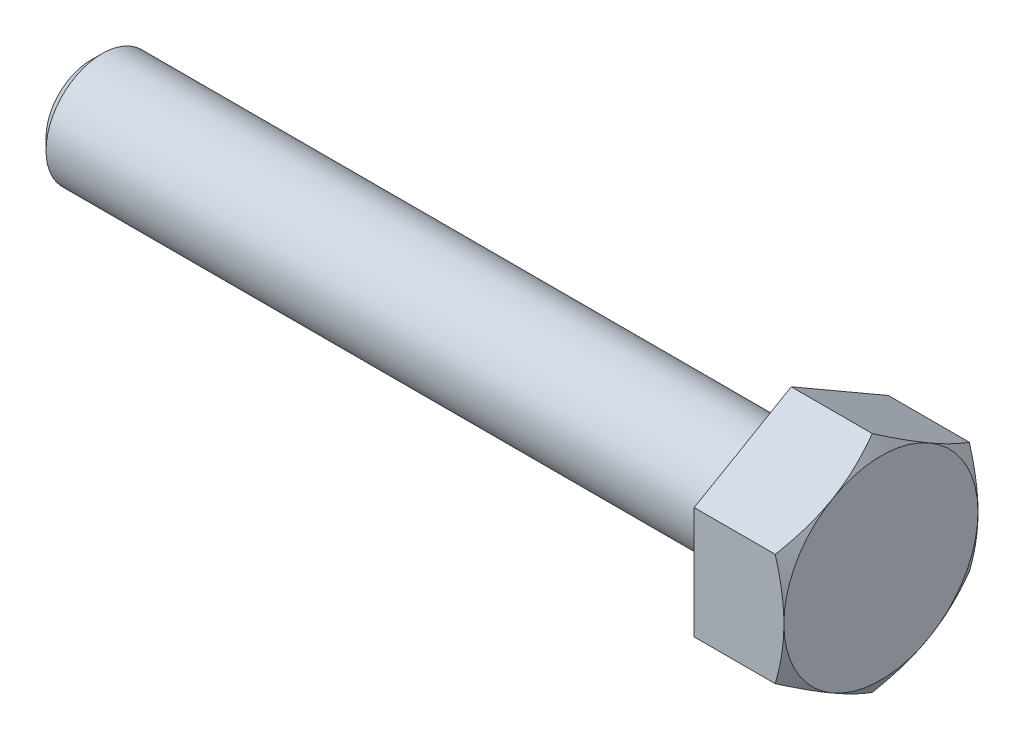
ISO-10303-21;
HEADER;
FILE_DESCRIPTION(('STEP AP214'),'2;1');
FILE_NAME('part.step','',(''),(''),'','','');
FILE_SCHEMA(('AUTOMOTIVE_DESIGN { 1 0 10303 214 1 1 1 1 }'));
ENDSEC;
DATA;
#1=APPLICATION_CONTEXT('core data for automotive mechanical design processes');
#2=APPLICATION_PROTOCOL_DEFINITION('international standard','automotive_design',2000,#1);
#3=PRODUCT_CONTEXT('',#1,'mechanical');
#4=PRODUCT('Part','Part','',(#3));
#5=PRODUCT_RELATED_PRODUCT_CATEGORY('part','',(#4));
#6=PRODUCT_DEFINITION_FORMATION('','',#4);
#7=PRODUCT_DEFINITION_CONTEXT('part definition',#1,'design');
#8=PRODUCT_DEFINITION('design','',#6,#7);
#9=PRODUCT_DEFINITION_SHAPE('','',#8);
#10=(LENGTH_UNIT() NAMED_UNIT(*) SI_UNIT(.MILLI.,.METRE.));
#11=(NAMED_UNIT(*) PLANE_ANGLE_UNIT() SI_UNIT($,.RADIAN.));
#12=(NAMED_UNIT(*) SI_UNIT($,.STERADIAN.) SOLID_ANGLE_UNIT());
#13=UNCERTAINTY_MEASURE_WITH_UNIT(LENGTH_MEASURE(1.E-05),#10,'distance_accuracy_value','');
#14=(GEOMETRIC_REPRESENTATION_CONTEXT(3) GLOBAL_UNCERTAINTY_ASSIGNED_CONTEXT((#13)) GLOBAL_UNIT_ASSIGNED_CONTEXT((#10,
#11,#12)) REPRESENTATION_CONTEXT('',''));
#15=CARTESIAN_POINT('',(0.,0.,0.));
#16=DIRECTION('',(0.,0.,1.));
#17=DIRECTION('',(1.,0.,0.));
#18=AXIS2_PLACEMENT_3D('',#15,#16,#17);
#19=CARTESIAN_POINT('',(19.2,12.0000000000002,-20.7846096908263));
#20=DIRECTION('',(0.,-0.866025403784441,0.499999999999995));
#21=DIRECTION('',(0.,-0.499999999999995,-0.866025403784441));
#22=AXIS2_PLACEMENT_3D('',#19,#20,#21);
#23=PLANE('',#22);
#24=CARTESIAN_POINT('',(17.3435268723012,11.9998845299464,-20.7848096908263));
#25=CARTESIAN_POINT('',(17.4957950231701,12.263639438313,-20.3279727887896));
#26=CARTESIAN_POINT('',(17.6411534574922,12.5284231322604,-19.869353977857));
#27=CARTESIAN_POINT('',(17.9161302416855,13.0601137691591,-18.9484387808398));
#28=CARTESIAN_POINT('',(18.0457434146858,13.3270213798631,-18.4861412381737));
#29=CARTESIAN_POINT('',(18.2874874041532,13.8634756923536,-17.5569751130007));
#30=CARTESIAN_POINT('',(18.3995768558665,14.1330270885873,-17.0900983994728));
#31=CARTESIAN_POINT('',(18.6038664716216,14.6740028630394,-16.1531008724577));
#32=CARTESIAN_POINT('',(18.6960677747242,14.9454271330728,-15.6829802463526));
#33=CARTESIAN_POINT('',(18.8566595090508,15.4831938662328,-14.7515409418991));
#34=CARTESIAN_POINT('',(18.9255814723418,15.749496406001,-14.290291412836));
#35=CARTESIAN_POINT('',(19.0411479838631,16.2833217102037,-13.3656788635909));
#36=CARTESIAN_POINT('',(19.0877921032801,16.5508444980261,-12.9023158029001));
#37=CARTESIAN_POINT('',(19.1576251858172,17.0863394659308,-11.9748113112916));
#38=CARTESIAN_POINT('',(19.1808420204719,17.3543107311896,-11.5106714648949));
#39=CARTESIAN_POINT('',(19.2033212604246,17.8905005573785,-10.5819634434342));
#40=CARTESIAN_POINT('',(19.2025844059287,18.158719110411,-10.1173952820493));
#41=CARTESIAN_POINT('',(19.178829236137,18.6601588540008,-9.24887616921747));
#42=CARTESIAN_POINT('',(19.1587076543317,18.8934157559949,-8.8448633637475));
#43=CARTESIAN_POINT('',(19.1007301929937,19.3593726906645,-8.0378022787607));
#44=CARTESIAN_POINT('',(19.0628745674587,19.5920727312677,-7.63475398551264));
#45=CARTESIAN_POINT('',(18.9700851020353,20.0568299673038,-6.82977083951278));
#46=CARTESIAN_POINT('',(18.9151358186335,20.2888863892026,-6.42783732656154));
#47=CARTESIAN_POINT('',(18.7891315548784,20.751888101785,-5.62589483637743));
#48=CARTESIAN_POINT('',(18.7180766427663,20.9828333971723,-5.22588585099749));
#49=CARTESIAN_POINT('',(18.4789299412627,21.6839341778009,-4.01154367772255));
#50=CARTESIAN_POINT('',(18.2869794527174,22.1520977019199,-3.20066066769793));
#51=CARTESIAN_POINT('',(17.9601926803062,22.8491727977797,-1.99329118497793));
#52=CARTESIAN_POINT('',(17.8449045107318,23.0804697165365,-1.59267317005701));
#53=CARTESIAN_POINT('',(17.6026566529107,23.541463698911,-0.794208170600846));
#54=CARTESIAN_POINT('',(17.4757002543211,23.7711611939319,-0.396360438853308));
#55=CARTESIAN_POINT('',(17.3435268723012,24.0001154700538,0.000199999999998563));
#56=B_SPLINE_CURVE_WITH_KNOTS('',3,(#24,#25,#26,#27,#28,#29,#30,#31,#32,#33,#34,#35,#36,#37,#38,
#39,#40,#41,#42,#43,#44,#45,#46,#47,#48,#49,#50,#51,#52,#53,#54,#55),.UNSPECIFIED.,.F.,.F.,(4,2,
2,2,2,2,2,2,2,2,2,2,2,2,2,4),(0.,1.64718297300076,3.2949060644356,4.94646171874213,
6.59792275780599,8.20862232704058,9.81935289844247,11.4281649098404,13.0369272065082,
14.4374315945823,15.8379159244003,17.239669235012,18.6414166063711,21.5066563429883,
22.9367804503369,24.366502588349),.UNSPECIFIED.);
#57=CARTESIAN_POINT('',(17.343593539449,12.0000000000003,-20.7846096908263));
#58=VERTEX_POINT('',#57);
#59=CARTESIAN_POINT('',(19.2,18.,-10.3923048454131));
#60=VERTEX_POINT('',#59);
#61=EDGE_CURVE('E124',#58,#60,#56,.T.);
#62=ORIENTED_EDGE('',*,*,#61,.F.);
#63=DIRECTION('',(-1.,0.,0.));
#64=VECTOR('',#63,1.);
#65=CARTESIAN_POINT('',(19.2,12.0000000000002,-20.7846096908263));
#66=LINE('',#65,#64);
#67=CARTESIAN_POINT('',(0.,12.0000000000002,-20.7846096908263));
#68=VERTEX_POINT('',#67);
#69=EDGE_CURVE('E73',#58,#68,#66,.T.);
#70=ORIENTED_EDGE('',*,*,#69,.T.);
#71=DIRECTION('',(0.,0.499999999999995,0.866025403784442));
#72=VECTOR('',#71,1.);
#73=CARTESIAN_POINT('',(0.,12.0000000000002,-20.7846096908263));
#74=LINE('',#73,#72);
#75=CARTESIAN_POINT('',(0.,24.,0.));
#76=VERTEX_POINT('',#75);
#77=EDGE_CURVE('E131',#68,#76,#74,.T.);
#78=ORIENTED_EDGE('',*,*,#77,.T.);
#79=DIRECTION('',(-1.,0.,0.));
#80=VECTOR('',#79,1.);
#81=CARTESIAN_POINT('',(19.2,24.,0.));
#82=LINE('',#81,#80);
#83=CARTESIAN_POINT('',(17.343593539449,24.,0.));
#84=VERTEX_POINT('',#83);
#85=EDGE_CURVE('E144',#84,#76,#82,.T.);
#86=ORIENTED_EDGE('',*,*,#85,.F.);
#87=EDGE_CURVE('E132',#60,#84,#56,.T.);
#88=ORIENTED_EDGE('',*,*,#87,.F.);
#89=EDGE_LOOP('',(#62,#70,#78,#86,#88));
#90=FACE_BOUND('',#89,.T.);
#91=ADVANCED_FACE('F49',(#90),#23,.F.);
#92=CARTESIAN_POINT('',(19.2,24.,0.));
#93=DIRECTION('',(0.,-0.866025403784438,-0.500000000000001));
#94=DIRECTION('',(0.,0.500000000000001,-0.866025403784438));
#95=AXIS2_PLACEMENT_3D('',#92,#93,#94);
#96=PLANE('',#95);
#97=CARTESIAN_POINT('',(17.3435268723012,24.0001154700538,-0.0002));
#98=CARTESIAN_POINT('',(17.4957950231701,23.7363605616871,0.456636902036743));
#99=CARTESIAN_POINT('',(17.6411534574922,23.4715768677398,0.915255712969346));
#100=CARTESIAN_POINT('',(17.9161302416855,22.9398862308411,1.83617090998652));
#101=CARTESIAN_POINT('',(18.0457434146858,22.6729786201371,2.29846845265265));
#102=CARTESIAN_POINT('',(18.2874874041532,22.1365243076466,3.22763457782561));
#103=CARTESIAN_POINT('',(18.3995768558665,21.8669729114129,3.69451129135352));
#104=CARTESIAN_POINT('',(18.6038664716216,21.3259971369607,4.63150881836862));
#105=CARTESIAN_POINT('',(18.6960677747242,21.0545728669273,5.10162944447371));
#106=CARTESIAN_POINT('',(18.8566595090508,20.5168061337673,6.03306874892723));
#107=CARTESIAN_POINT('',(18.9255814723418,20.2505035939992,6.49431827799028));
#108=CARTESIAN_POINT('',(19.0411479838631,19.7166782897964,7.41893082723536));
#109=CARTESIAN_POINT('',(19.0877921032801,19.449155501974,7.88229388792625));
#110=CARTESIAN_POINT('',(19.1576251858173,18.9136605340693,8.80979837953467));
#111=CARTESIAN_POINT('',(19.180842020472,18.6456892688105,9.27393822593137));
#112=CARTESIAN_POINT('',(19.2033212604247,18.1094994426216,10.2026462473921));
#113=CARTESIAN_POINT('',(19.2025844059287,17.8412808895891,10.667214408777));
#114=CARTESIAN_POINT('',(19.178829236137,17.3398411459993,11.5357335216088));
#115=CARTESIAN_POINT('',(19.1587076543318,17.1065842440051,11.9397463270788));
#116=CARTESIAN_POINT('',(19.1007301929938,16.6406273093355,12.7468074120656));
#117=CARTESIAN_POINT('',(19.0628745674587,16.4079272687323,13.1498557053137));
#118=CARTESIAN_POINT('',(18.9700851020354,15.9431700326962,13.9548388513136));
#119=CARTESIAN_POINT('',(18.9151358186335,15.7111136107975,14.3567723642648));
#120=CARTESIAN_POINT('',(18.7891315548785,15.2481118982151,15.1587148544489));
#121=CARTESIAN_POINT('',(18.7180766427664,15.0171666028277,15.5587238398289));
#122=CARTESIAN_POINT('',(18.4789299412628,14.316065822199,16.7730660131039));
#123=CARTESIAN_POINT('',(18.2869794527175,13.84790229808,17.5839490231285));
#124=CARTESIAN_POINT('',(17.9601926803062,13.1508272022203,18.7913185058485));
#125=CARTESIAN_POINT('',(17.8449045107319,12.9195302834635,19.1919365207695));
#126=CARTESIAN_POINT('',(17.6026566529107,12.4585363010889,19.9904015202257));
#127=CARTESIAN_POINT('',(17.4757002543211,12.228838806068,20.3882492519732));
#128=CARTESIAN_POINT('',(17.3435268723012,11.9998845299461,20.7848096908265));
#129=B_SPLINE_CURVE_WITH_KNOTS('',3,(#97,#98,#99,#100,#101,#102,#103,#104,#105,#106,#107,#108,
#109,#110,#111,#112,#113,#114,#115,#116,#117,#118,#119,#120,#121,#122,#123,#124,#125,#126,#127,
#128),.UNSPECIFIED.,.F.,.F.,(4,2,2,2,2,2,2,2,2,2,2,2,2,2,2,4),(0.,1.64718297300076,
3.2949060644356,4.94646171874214,6.597922757806,8.20862232704059,9.81935289844247,
11.4281649098404,13.0369272065082,14.4374315945823,15.8379159244004,17.2396692350121,
18.6414166063712,21.5066563429886,22.9367804503372,24.3665025883493),.UNSPECIFIED.);
#130=CARTESIAN_POINT('',(19.2,17.9999999999999,10.3923048454133));
#131=VERTEX_POINT('',#130);
#132=EDGE_CURVE('E137',#84,#131,#129,.T.);
#133=ORIENTED_EDGE('',*,*,#132,.F.);
#134=ORIENTED_EDGE('',*,*,#85,.T.);
#135=DIRECTION('',(0.,-0.500000000000001,0.866025403784438));
#136=VECTOR('',#135,1.);
#137=CARTESIAN_POINT('',(0.,24.,0.));
#138=LINE('',#137,#136);
#139=CARTESIAN_POINT('',(0.,11.9999999999999,20.7846096908265));
#140=VERTEX_POINT('',#139);
#141=EDGE_CURVE('E278',#76,#140,#138,.T.);
#142=ORIENTED_EDGE('',*,*,#141,.T.);
#143=DIRECTION('',(-1.,0.,0.));
#144=VECTOR('',#143,1.);
#145=CARTESIAN_POINT('',(19.2,11.9999999999999,20.7846096908265));
#146=LINE('',#145,#144);
#147=CARTESIAN_POINT('',(17.343593539449,11.9999999999999,20.7846096908265));
#148=VERTEX_POINT('',#147);
#149=EDGE_CURVE('E217',#148,#140,#146,.T.);
#150=ORIENTED_EDGE('',*,*,#149,.F.);
#151=EDGE_CURVE('E145',#131,#148,#129,.T.);
#152=ORIENTED_EDGE('',*,*,#151,.F.);
#153=EDGE_LOOP('',(#133,#134,#142,#150,#152));
#154=FACE_BOUND('',#153,.T.);
#155=ADVANCED_FACE('F205',(#154),#96,.F.);
#156=CARTESIAN_POINT('',(19.2,11.9999999999999,20.7846096908265));
#157=DIRECTION('',(0.,0.,-1.));
#158=DIRECTION('',(0.,1.,0.));
#159=AXIS2_PLACEMENT_3D('',#156,#157,#158);
#160=PLANE('',#159);
#161=CARTESIAN_POINT('',(3.76342461730577,42.7351963396776,20.7846096908266));
#162=CARTESIAN_POINT('',(4.0217998769859,42.2375504579258,20.7846096908266));
#163=CARTESIAN_POINT('',(4.27949915757842,41.7395537279378,20.7846096908266));
#164=CARTESIAN_POINT('',(4.79340647647786,40.7427897192708,20.7846096908266));
#165=CARTESIAN_POINT('',(5.0496145105572,40.2440224384125,20.7846096908266));
#166=CARTESIAN_POINT('',(5.81581250232179,38.7464229614953,20.7846096908266));
#167=CARTESIAN_POINT('',(6.32335419205207,37.7463357499288,20.7846096908266));
#168=CARTESIAN_POINT('',(7.33129538895053,35.7405852853729,20.7846096908266));
#169=CARTESIAN_POINT('',(7.83168234761047,34.7349157197308,20.7846096908266));
#170=CARTESIAN_POINT('',(8.82264705551387,32.718765685221,20.7846096908266));
#171=CARTESIAN_POINT('',(9.31322495581521,31.7082852907364,20.7846096908266));
#172=CARTESIAN_POINT('',(10.3090178760169,29.6253151675214,20.7846096908266));
#173=CARTESIAN_POINT('',(10.8135374476021,28.5524923063502,20.7846096908266));
#174=CARTESIAN_POINT('',(11.8052265689669,26.3987607200869,20.7846096908266));
#175=CARTESIAN_POINT('',(12.2923953981161,25.3178516614009,20.7846096908266));
#176=CARTESIAN_POINT('',(13.0060408898936,23.6893359387003,20.7846096908266));
#177=CARTESIAN_POINT('',(13.241012036702,23.1454489410645,20.7846096908265));
#178=CARTESIAN_POINT('',(13.7044499258193,22.0549139153183,20.7846096908265));
#179=CARTESIAN_POINT('',(13.9329167531097,21.5082659233914,20.7846096908265));
#180=CARTESIAN_POINT('',(14.3823664080821,20.4119412090459,20.7846096908265));
#181=CARTESIAN_POINT('',(14.6033497579944,19.862264701096,20.7846096908265));
#182=CARTESIAN_POINT('',(15.0366990711674,18.7595322812737,20.7846096908265));
#183=CARTESIAN_POINT('',(15.2490652080702,18.2064764377554,20.7846096908265));
#184=CARTESIAN_POINT('',(15.6903533859146,17.0257175003697,20.7846096908265));
#185=CARTESIAN_POINT('',(15.9179230026686,16.3975069770107,20.7846096908265));
#186=CARTESIAN_POINT('',(16.3581471300787,15.1358634730651,20.7846096908265));
#187=CARTESIAN_POINT('',(16.5708016751309,14.5024305045259,20.7846096908265));
#188=CARTESIAN_POINT('',(16.97857202958,13.2297874539747,20.7846096908265));
#189=CARTESIAN_POINT('',(17.1736845821637,12.5905763233441,20.7846096908265));
#190=CARTESIAN_POINT('',(17.5432592250528,11.3061766050274,20.7846096908265));
#191=CARTESIAN_POINT('',(17.7177213464759,10.6609880263502,20.7846096908265));
#192=CARTESIAN_POINT('',(18.0393055717577,9.37757944037587,20.7846096908265));
#193=CARTESIAN_POINT('',(18.1869070802664,8.73948035870569,20.7846096908265));
#194=CARTESIAN_POINT('',(18.4555718401117,7.45773163993489,20.7846096908265));
#195=CARTESIAN_POINT('',(18.5766374182426,6.81408249463781,20.7846096908265));
#196=CARTESIAN_POINT('',(18.7888399212671,5.52212335543818,20.7846096908265));
#197=CARTESIAN_POINT('',(18.879990457561,4.87381561880363,20.7846096908265));
#198=CARTESIAN_POINT('',(19.0294981172202,3.57339987577268,20.7846096908265));
#199=CARTESIAN_POINT('',(19.0878557255006,2.9212919257148,20.7846096908265));
#200=CARTESIAN_POINT('',(19.1703140665286,1.604632924159,20.7846096908265));
#201=CARTESIAN_POINT('',(19.1938641321273,0.940046910142519,20.7846096908265));
#202=CARTESIAN_POINT('',(19.204030391089,-0.389409138129768,20.7846096908265));
#203=CARTESIAN_POINT('',(19.1906466331135,-1.05427917201021,20.7846096908265));
#204=CARTESIAN_POINT('',(19.127473258216,-2.38241239876372,20.7846096908265));
#205=CARTESIAN_POINT('',(19.0776756810162,-3.04567520847451,20.7846096908265));
#206=CARTESIAN_POINT('',(18.9435587785108,-4.36867761851296,20.7846096908265));
#207=CARTESIAN_POINT('',(18.8592385439934,-5.02841712558492,20.7846096908265));
#208=CARTESIAN_POINT('',(18.6568671457578,-6.35687047190902,20.7846096908264));
#209=CARTESIAN_POINT('',(18.5381432508851,-7.02548085274418,20.7846096908264));
#210=CARTESIAN_POINT('',(18.271401694146,-8.35678717792432,20.7846096908264));
#211=CARTESIAN_POINT('',(18.1233835768543,-9.01948303015111,20.7846096908264));
#212=CARTESIAN_POINT('',(17.8018250395631,-10.3388158753969,20.7846096908264));
#213=CARTESIAN_POINT('',(17.6282769895872,-10.9954509945151,20.7846096908264));
#214=CARTESIAN_POINT('',(17.2593302530432,-12.3025159921133,20.7846096908264));
#215=CARTESIAN_POINT('',(17.0639314973765,-12.9529458509631,20.7846096908264));
#216=CARTESIAN_POINT('',(16.6521235226639,-14.2556215747884,20.7846096908264));
#217=CARTESIAN_POINT('',(16.4354916580091,-14.9077966991281,20.7846096908264));
#218=CARTESIAN_POINT('',(15.9861491034795,-16.2066062021254,20.7846096908264));
#219=CARTESIAN_POINT('',(15.7534373926133,-16.8532402260149,20.7846096908264));
#220=CARTESIAN_POINT('',(15.274391678855,-18.1416069191262,20.7846096908264));
#221=CARTESIAN_POINT('',(15.0280543260464,-18.7833383384918,20.7846096908264));
#222=CARTESIAN_POINT('',(14.5239117501619,-20.0622534059696,20.7846096908264));
#223=CARTESIAN_POINT('',(14.2661067525744,-20.6994371432174,20.7846096908264));
#224=CARTESIAN_POINT('',(13.7404274743531,-21.9705929002849,20.7846096908264));
#225=CARTESIAN_POINT('',(13.472540609056,-22.6045597040991,20.7846096908264));
#226=CARTESIAN_POINT('',(12.9284600902016,-23.8689150095967,20.7846096908264));
#227=CARTESIAN_POINT('',(12.6522664037446,-24.4993034970964,20.7846096908264));
#228=CARTESIAN_POINT('',(12.0928140658874,-25.7568294075045,20.7846096908264));
#229=CARTESIAN_POINT('',(11.8095563903339,-26.3839672651679,20.7846096908264));
#230=CARTESIAN_POINT('',(11.2369322661728,-27.6354418873609,20.7846096908264));
#231=CARTESIAN_POINT('',(10.9475658301735,-28.2597786576686,20.7846096908264));
#232=CARTESIAN_POINT('',(10.1073878955883,-30.052670015556,20.7846096908264));
#233=CARTESIAN_POINT('',(9.549935979559,-31.2181138600505,20.7846096908264));
#234=CARTESIAN_POINT('',(8.42077327483183,-33.5421025420666,20.7846096908264));
#235=CARTESIAN_POINT('',(7.84906192836635,-34.7006471075152,20.7846096908264));
#236=CARTESIAN_POINT('',(6.69664324710512,-37.0077945469624,20.7846096908264));
#237=CARTESIAN_POINT('',(6.11597792943075,-38.1564184327318,20.7846096908263));
#238=CARTESIAN_POINT('',(5.23838112008893,-39.8759132018086,20.7846096908263));
#239=CARTESIAN_POINT('',(4.94476224673455,-40.4484792332989,20.7846096908263));
#240=CARTESIAN_POINT('',(4.35553330993649,-41.5925826559037,20.7846096908263));
#241=CARTESIAN_POINT('',(4.0599232555947,-42.164120051705,20.7846096908263));
#242=CARTESIAN_POINT('',(3.76342461730577,-42.7351963396777,20.7846096908263));
#243=B_SPLINE_CURVE_WITH_KNOTS('',3,(#161,#162,#163,#164,#165,#166,#167,#168,#169,#170,#171,
#172,#173,#174,#175,#176,#177,#178,#179,#180,#181,#182,#183,#184,#185,#186,#187,#188,#189,#190,
#191,#192,#193,#194,#195,#196,#197,#198,#199,#200,#201,#202,#203,#204,#205,#206,#207,#208,#209,
#210,#211,#212,#213,#214,#215,#216,#217,#218,#219,#220,#221,#222,#223,#224,#225,#226,#227,#228,
#229,#230,#231,#232,#233,#234,#235,#236,#237,#238,#239,#240,#241,#242),.UNSPECIFIED.,.F.,.F.,(4,
2,2,2,2,2,2,2,2,2,2,2,2,2,2,2,2,2,2,2,2,2,2,2,2,2,2,2,2,2,2,2,2,2,2,2,2,2,2,2,4),(0.,
1.68216511624376,3.36433499901151,6.72881886572706,10.0986173985111,13.4683639969219,
17.0248524624178,20.5814884680961,22.3588742955726,24.1362368900912,25.9134751956865,
27.6906776710652,29.69499374197,31.6993051905018,33.7039879905967,35.7086677698427,
37.6730184948025,39.6371969073429,41.600480371979,43.5637348044196,45.5577279859555,
47.551718540339,49.5461451232968,51.5406242361864,53.5770909409603,55.6135893083398,
57.6506975528629,59.6878122395321,61.7492048973111,63.810728563878,65.8727613364008,
67.9347535810603,69.9994111245146,72.0640768461976,74.1284589098883,76.192836713184,
80.068401521298,83.9441181633393,87.8052301786373,89.7356145319587,91.6659900672801),.UNSPECIFIED.);
#244=CARTESIAN_POINT('',(19.2,0.,20.7846096908265));
#245=VERTEX_POINT('',#244);
#246=EDGE_CURVE('E199',#148,#245,#243,.T.);
#247=ORIENTED_EDGE('',*,*,#246,.F.);
#248=ORIENTED_EDGE('',*,*,#149,.T.);
#249=DIRECTION('',(0.,-1.,0.));
#250=VECTOR('',#249,1.);
#251=CARTESIAN_POINT('',(0.,11.9999999999999,20.7846096908265));
#252=LINE('',#251,#250);
#253=CARTESIAN_POINT('',(0.,-12.0000000000001,20.7846096908264));
#254=VERTEX_POINT('',#253);
#255=EDGE_CURVE('E235',#140,#254,#252,.T.);
#256=ORIENTED_EDGE('',*,*,#255,.T.);
#257=DIRECTION('',(-1.,0.,0.));
#258=VECTOR('',#257,1.);
#259=CARTESIAN_POINT('',(19.2,-12.0000000000001,20.7846096908264));
#260=LINE('',#259,#258);
#261=CARTESIAN_POINT('',(17.343593539449,-12.0000000000001,20.7846096908264));
#262=VERTEX_POINT('',#261);
#263=EDGE_CURVE('E233',#262,#254,#260,.T.);
#264=ORIENTED_EDGE('',*,*,#263,.F.);
#265=EDGE_CURVE('E193',#245,#262,#243,.T.);
#266=ORIENTED_EDGE('',*,*,#265,.F.);
#267=EDGE_LOOP('',(#247,#248,#256,#264,#266));
#268=FACE_BOUND('',#267,.T.);
#269=ADVANCED_FACE('F201',(#268),#160,.F.);
#270=CARTESIAN_POINT('',(19.2,-12.0000000000001,20.7846096908264));
#271=DIRECTION('',(0.,0.866025403784441,-0.499999999999995));
#272=DIRECTION('',(0.,0.499999999999995,0.866025403784442));
#273=AXIS2_PLACEMENT_3D('',#270,#271,#272);
#274=PLANE('',#273);
#275=CARTESIAN_POINT('',(17.3435268723012,-11.9998845299462,20.7848096908264));
#276=CARTESIAN_POINT('',(17.4957950231701,-12.2636394383129,20.3279727887897));
#277=CARTESIAN_POINT('',(17.6411534574922,-12.5284231322603,19.8693539778571));
#278=CARTESIAN_POINT('',(17.9161302416855,-13.0601137691589,18.9484387808399));
#279=CARTESIAN_POINT('',(18.0457434146858,-13.3270213798629,18.4861412381738));
#280=CARTESIAN_POINT('',(18.2874874041532,-13.8634756923534,17.5569751130008));
#281=CARTESIAN_POINT('',(18.3995768558665,-14.1330270885871,17.0900983994729));
#282=CARTESIAN_POINT('',(18.6038664716216,-14.6740028630393,16.1531008724578));
#283=CARTESIAN_POINT('',(18.6960677747242,-14.9454271330727,15.6829802463527));
#284=CARTESIAN_POINT('',(18.8566595090508,-15.4831938662327,14.7515409418992));
#285=CARTESIAN_POINT('',(18.9255814723418,-15.7494964060008,14.2902914128361));
#286=CARTESIAN_POINT('',(19.0411479838631,-16.2833217102036,13.365678863591));
#287=CARTESIAN_POINT('',(19.0877921032801,-16.550844498026,12.9023158029002));
#288=CARTESIAN_POINT('',(19.1576251858173,-17.0863394659307,11.9748113112917));
#289=CARTESIAN_POINT('',(19.180842020472,-17.3543107311895,11.510671464895));
#290=CARTESIAN_POINT('',(19.2033212604247,-17.8905005573784,10.5819634434343));
#291=CARTESIAN_POINT('',(19.2025844059287,-18.1587191104109,10.1173952820494));
#292=CARTESIAN_POINT('',(19.178829236137,-18.6601588540007,9.24887616921756));
#293=CARTESIAN_POINT('',(19.1587076543318,-18.8934157559948,8.84486336374757));
#294=CARTESIAN_POINT('',(19.1007301929938,-19.3593726906644,8.03780227876075));
#295=CARTESIAN_POINT('',(19.0628745674587,-19.5920727312676,7.63475398551268));
#296=CARTESIAN_POINT('',(18.9700851020354,-20.0568299673037,6.8297708395128));
#297=CARTESIAN_POINT('',(18.9151358186335,-20.2888863892025,6.42783732656155));
#298=CARTESIAN_POINT('',(18.7891315548785,-20.7518881017849,5.62589483637742));
#299=CARTESIAN_POINT('',(18.7180766427664,-20.9828333971723,5.22588585099747));
#300=CARTESIAN_POINT('',(18.4789299412628,-21.6839341778009,4.01154367772249));
#301=CARTESIAN_POINT('',(18.2869794527175,-22.1520977019199,3.20066066769785));
#302=CARTESIAN_POINT('',(17.9601926803062,-22.8491727977796,1.99329118497782));
#303=CARTESIAN_POINT('',(17.8449045107319,-23.0804697165364,1.59267317005689));
#304=CARTESIAN_POINT('',(17.6026566529107,-23.5414636989109,0.794208170600704));
#305=CARTESIAN_POINT('',(17.4757002543211,-23.7711611939319,0.396360438853154));
#306=CARTESIAN_POINT('',(17.3435268723012,-24.0001154700538,-0.000200000000165741));
#307=B_SPLINE_CURVE_WITH_KNOTS('',3,(#275,#276,#277,#278,#279,#280,#281,#282,#283,#284,#285,
#286,#287,#288,#289,#290,#291,#292,#293,#294,#295,#296,#297,#298,#299,#300,#301,#302,#303,#304,
#305,#306),.UNSPECIFIED.,.F.,.F.,(4,2,2,2,2,2,2,2,2,2,2,2,2,2,2,4),(0.,1.64718297300076,
3.29490606443561,4.94646171874214,6.59792275780599,8.20862232704058,9.81935289844247,
11.4281649098404,13.0369272065082,14.4374315945823,15.8379159244004,17.2396692350121,
18.6414166063712,21.5066563429886,22.9367804503372,24.3665025883493),.UNSPECIFIED.);
#308=CARTESIAN_POINT('',(19.2,-18.,10.3923048454131));
#309=VERTEX_POINT('',#308);
#310=EDGE_CURVE('E200',#262,#309,#307,.T.);
#311=ORIENTED_EDGE('',*,*,#310,.F.);
#312=ORIENTED_EDGE('',*,*,#263,.T.);
#313=DIRECTION('',(0.,-0.499999999999995,-0.866025403784441));
#314=VECTOR('',#313,1.);
#315=CARTESIAN_POINT('',(0.,-12.0000000000001,20.7846096908264));
#316=LINE('',#315,#314);
#317=CARTESIAN_POINT('',(0.,-24.,-1.6759110426447E-13));
#318=VERTEX_POINT('',#317);
#319=EDGE_CURVE('E275',#254,#318,#316,.T.);
#320=ORIENTED_EDGE('',*,*,#319,.T.);
#321=DIRECTION('',(-1.,0.,0.));
#322=VECTOR('',#321,1.);
#323=CARTESIAN_POINT('',(19.2,-24.,-1.6759110426447E-13));
#324=LINE('',#323,#322);
#325=CARTESIAN_POINT('',(17.343593539449,-24.,-1.6700373529656E-13));
#326=VERTEX_POINT('',#325);
#327=EDGE_CURVE('E239',#326,#318,#324,.T.);
#328=ORIENTED_EDGE('',*,*,#327,.F.);
#329=EDGE_CURVE('E187',#309,#326,#307,.T.);
#330=ORIENTED_EDGE('',*,*,#329,.F.);
#331=EDGE_LOOP('',(#311,#312,#320,#328,#330));
#332=FACE_BOUND('',#331,.T.);
#333=ADVANCED_FACE('F204',(#332),#274,.F.);
#334=CARTESIAN_POINT('',(19.2,-24.,-1.6759110426447E-13));
#335=DIRECTION('',(0.,0.866025403784434,0.500000000000007));
#336=DIRECTION('',(0.,-0.500000000000007,0.866025403784435));
#337=AXIS2_PLACEMENT_3D('',#334,#335,#336);
#338=PLANE('',#337);
#339=CARTESIAN_POINT('',(17.3435268723012,-24.0001154700538,0.000199999999832648));
#340=CARTESIAN_POINT('',(17.4957950231701,-23.7363605616871,-0.456636902036909));
#341=CARTESIAN_POINT('',(17.6411534574922,-23.4715768677397,-0.915255712969511));
#342=CARTESIAN_POINT('',(17.9161302416855,-22.9398862308411,-1.83617090998668));
#343=CARTESIAN_POINT('',(18.0457434146858,-22.6729786201371,-2.2984684526528));
#344=CARTESIAN_POINT('',(18.2874874041532,-22.1365243076466,-3.22763457782576));
#345=CARTESIAN_POINT('',(18.3995768558665,-21.8669729114129,-3.69451129135368));
#346=CARTESIAN_POINT('',(18.6038664716216,-21.3259971369607,-4.63150881836877));
#347=CARTESIAN_POINT('',(18.6960677747242,-21.0545728669273,-5.10162944447385));
#348=CARTESIAN_POINT('',(18.8566595090508,-20.5168061337672,-6.03306874892738));
#349=CARTESIAN_POINT('',(18.9255814723418,-20.2505035939991,-6.49431827799042));
#350=CARTESIAN_POINT('',(19.0411479838631,-19.7166782897963,-7.41893082723551));
#351=CARTESIAN_POINT('',(19.0877921032801,-19.4491555019739,-7.88229388792639));
#352=CARTESIAN_POINT('',(19.1576251858173,-18.9136605340692,-8.80979837953481));
#353=CARTESIAN_POINT('',(19.180842020472,-18.6456892688104,-9.27393822593151));
#354=CARTESIAN_POINT('',(19.2033212604247,-18.1094994426215,-10.2026462473923));
#355=CARTESIAN_POINT('',(19.2025844059287,-17.841280889589,-10.6672144087771));
#356=CARTESIAN_POINT('',(19.178829236137,-17.3398411459992,-11.535733521609));
#357=CARTESIAN_POINT('',(19.1587076543318,-17.106584244005,-11.9397463270789));
#358=CARTESIAN_POINT('',(19.1007301929938,-16.6406273093354,-12.7468074120658));
#359=CARTESIAN_POINT('',(19.0628745674588,-16.4079272687322,-13.1498557053138));
#360=CARTESIAN_POINT('',(18.9700851020354,-15.9431700326961,-13.9548388513137));
#361=CARTESIAN_POINT('',(18.9151358186335,-15.7111136107974,-14.3567723642649));
#362=CARTESIAN_POINT('',(18.7891315548785,-15.2481118982149,-15.1587148544491));
#363=CARTESIAN_POINT('',(18.7180766427664,-15.0171666028276,-15.558723839829));
#364=CARTESIAN_POINT('',(18.4789299412628,-14.3160658221989,-16.773066013104));
#365=CARTESIAN_POINT('',(18.2869794527175,-13.8479022980799,-17.5839490231286));
#366=CARTESIAN_POINT('',(17.9601926803062,-13.1508272022201,-18.7913185058486));
#367=CARTESIAN_POINT('',(17.8449045107319,-12.9195302834633,-19.1919365207696));
#368=CARTESIAN_POINT('',(17.6026566529107,-12.4585363010888,-19.9904015202257));
#369=CARTESIAN_POINT('',(17.4757002543212,-12.2288388060679,-20.3882492519733));
#370=CARTESIAN_POINT('',(17.3435268723012,-11.9998845299459,-20.7848096908266));
#371=B_SPLINE_CURVE_WITH_KNOTS('',3,(#339,#340,#341,#342,#343,#344,#345,#346,#347,#348,#349,
#350,#351,#352,#353,#354,#355,#356,#357,#358,#359,#360,#361,#362,#363,#364,#365,#366,#367,#368,
#369,#370),.UNSPECIFIED.,.F.,.F.,(4,2,2,2,2,2,2,2,2,2,2,2,2,2,2,4),(0.,1.64718297300076,
3.29490606443561,4.94646171874214,6.597922757806,8.20862232704059,9.81935289844247,
11.4281649098404,13.0369272065082,14.4374315945823,15.8379159244004,17.2396692350121,
18.6414166063712,21.5066563429886,22.9367804503372,24.3665025883493),.UNSPECIFIED.);
#372=CARTESIAN_POINT('',(19.2,-17.9999999999999,-10.3923048454134));
#373=VERTEX_POINT('',#372);
#374=EDGE_CURVE('E259',#326,#373,#371,.T.);
#375=ORIENTED_EDGE('',*,*,#374,.F.);
#376=ORIENTED_EDGE('',*,*,#327,.T.);
#377=DIRECTION('',(0.,0.500000000000007,-0.866025403784434));
#378=VECTOR('',#377,1.);
#379=CARTESIAN_POINT('',(0.,-24.,-1.6759110426447E-13));
#380=LINE('',#379,#378);
#381=CARTESIAN_POINT('',(0.,-11.9999999999998,-20.7846096908266));
#382=VERTEX_POINT('',#381);
#383=EDGE_CURVE('E271',#318,#382,#380,.T.);
#384=ORIENTED_EDGE('',*,*,#383,.T.);
#385=DIRECTION('',(-1.,0.,0.));
#386=VECTOR('',#385,1.);
#387=CARTESIAN_POINT('',(19.2,-11.9999999999998,-20.7846096908266));
#388=LINE('',#387,#386);
#389=CARTESIAN_POINT('',(17.343593539449,-11.9999999999998,-20.7846096908266));
#390=VERTEX_POINT('',#389);
#391=EDGE_CURVE('E242',#390,#382,#388,.T.);
#392=ORIENTED_EDGE('',*,*,#391,.F.);
#393=EDGE_CURVE('E180',#373,#390,#371,.T.);
#394=ORIENTED_EDGE('',*,*,#393,.F.);
#395=EDGE_LOOP('',(#375,#376,#384,#392,#394));
#396=FACE_BOUND('',#395,.T.);
#397=ADVANCED_FACE('F258',(#396),#338,.F.);
#398=CARTESIAN_POINT('',(19.2,-11.9999999999998,-20.7846096908266));
#399=DIRECTION('',(0.,0.,1.));
#400=DIRECTION('',(0.,-1.,0.));
#401=AXIS2_PLACEMENT_3D('',#398,#399,#400);
#402=PLANE('',#401);
#403=CARTESIAN_POINT('',(3.76342461730577,-42.7351963396775,-20.7846096908269));
#404=CARTESIAN_POINT('',(4.0217998769859,-42.2375504579256,-20.7846096908269));
#405=CARTESIAN_POINT('',(4.27949915757842,-41.7395537279376,-20.7846096908269));
#406=CARTESIAN_POINT('',(4.79340647647787,-40.7427897192707,-20.7846096908269));
#407=CARTESIAN_POINT('',(5.04961451055721,-40.2440224384124,-20.7846096908269));
#408=CARTESIAN_POINT('',(5.8158125023218,-38.7464229614952,-20.7846096908269));
#409=CARTESIAN_POINT('',(6.32335419205207,-37.7463357499286,-20.7846096908269));
#410=CARTESIAN_POINT('',(7.33129538895053,-35.7405852853727,-20.7846096908268));
#411=CARTESIAN_POINT('',(7.83168234761048,-34.7349157197307,-20.7846096908268));
#412=CARTESIAN_POINT('',(8.82264705551388,-32.7187656852208,-20.7846096908268));
#413=CARTESIAN_POINT('',(9.31322495581522,-31.7082852907362,-20.7846096908268));
#414=CARTESIAN_POINT('',(10.3090178760169,-29.6253151675212,-20.7846096908268));
#415=CARTESIAN_POINT('',(10.8135374476021,-28.55249230635,-20.7846096908268));
#416=CARTESIAN_POINT('',(11.8052265689669,-26.3987607200868,-20.7846096908267));
#417=CARTESIAN_POINT('',(12.2923953981161,-25.3178516614007,-20.7846096908267));
#418=CARTESIAN_POINT('',(13.0060408898936,-23.6893359387002,-20.7846096908267));
#419=CARTESIAN_POINT('',(13.241012036702,-23.1454489410644,-20.7846096908267));
#420=CARTESIAN_POINT('',(13.7044499258193,-22.0549139153181,-20.7846096908267));
#421=CARTESIAN_POINT('',(13.9329167531097,-21.5082659233912,-20.7846096908267));
#422=CARTESIAN_POINT('',(14.3823664080821,-20.4119412090457,-20.7846096908267));
#423=CARTESIAN_POINT('',(14.6033497579944,-19.8622647010959,-20.7846096908267));
#424=CARTESIAN_POINT('',(15.0366990711674,-18.7595322812735,-20.7846096908267));
#425=CARTESIAN_POINT('',(15.2490652080702,-18.2064764377553,-20.7846096908267));
#426=CARTESIAN_POINT('',(15.6903533859146,-17.0257175003696,-20.7846096908266));
#427=CARTESIAN_POINT('',(15.9179230026686,-16.3975069770106,-20.7846096908266));
#428=CARTESIAN_POINT('',(16.3581471300787,-15.135863473065,-20.7846096908266));
#429=CARTESIAN_POINT('',(16.5708016751309,-14.5024305045258,-20.7846096908266));
#430=CARTESIAN_POINT('',(16.97857202958,-13.2297874539745,-20.7846096908266));
#431=CARTESIAN_POINT('',(17.1736845821637,-12.5905763233439,-20.7846096908266));
#432=CARTESIAN_POINT('',(17.5432592250528,-11.3061766050272,-20.7846096908266));
#433=CARTESIAN_POINT('',(17.7177213464759,-10.6609880263501,-20.7846096908266));
#434=CARTESIAN_POINT('',(18.0393055717577,-9.3775794403757,-20.7846096908266));
#435=CARTESIAN_POINT('',(18.1869070802664,-8.73948035870552,-20.7846096908266));
#436=CARTESIAN_POINT('',(18.4555718401117,-7.45773163993473,-20.7846096908265));
#437=CARTESIAN_POINT('',(18.5766374182426,-6.81408249463765,-20.7846096908265));
#438=CARTESIAN_POINT('',(18.7888399212671,-5.52212335543801,-20.7846096908265));
#439=CARTESIAN_POINT('',(18.879990457561,-4.87381561880347,-20.7846096908265));
#440=CARTESIAN_POINT('',(19.0294981172202,-3.57339987577251,-20.7846096908265));
#441=CARTESIAN_POINT('',(19.0878557255006,-2.92129192571464,-20.7846096908265));
#442=CARTESIAN_POINT('',(19.1703140665286,-1.60463292415884,-20.7846096908265));
#443=CARTESIAN_POINT('',(19.1938641321273,-0.940046910142354,-20.7846096908265));
#444=CARTESIAN_POINT('',(19.204030391089,0.389409138129932,-20.7846096908265));
#445=CARTESIAN_POINT('',(19.1906466331135,1.05427917201038,-20.7846096908265));
#446=CARTESIAN_POINT('',(19.127473258216,2.38241239876388,-20.7846096908264));
#447=CARTESIAN_POINT('',(19.0776756810162,3.04567520847468,-20.7846096908264));
#448=CARTESIAN_POINT('',(18.9435587785108,4.36867761851312,-20.7846096908264));
#449=CARTESIAN_POINT('',(18.8592385439934,5.02841712558508,-20.7846096908264));
#450=CARTESIAN_POINT('',(18.6568671457578,6.35687047190918,-20.7846096908264));
#451=CARTESIAN_POINT('',(18.5381432508851,7.02548085274435,-20.7846096908264));
#452=CARTESIAN_POINT('',(18.271401694146,8.35678717792449,-20.7846096908264));
#453=CARTESIAN_POINT('',(18.1233835768543,9.01948303015128,-20.7846096908264));
#454=CARTESIAN_POINT('',(17.8018250395631,10.3388158753971,-20.7846096908264));
#455=CARTESIAN_POINT('',(17.6282769895872,10.9954509945153,-20.7846096908264));
#456=CARTESIAN_POINT('',(17.2593302530432,12.3025159921134,-20.7846096908263));
#457=CARTESIAN_POINT('',(17.0639314973765,12.9529458509633,-20.7846096908263));
#458=CARTESIAN_POINT('',(16.6521235226639,14.2556215747886,-20.7846096908263));
#459=CARTESIAN_POINT('',(16.4354916580091,14.9077966991282,-20.7846096908263));
#460=CARTESIAN_POINT('',(15.9861491034795,16.2066062021255,-20.7846096908263));
#461=CARTESIAN_POINT('',(15.7534373926133,16.853240226015,-20.7846096908263));
#462=CARTESIAN_POINT('',(15.274391678855,18.1416069191263,-20.7846096908263));
#463=CARTESIAN_POINT('',(15.0280543260464,18.783338338492,-20.7846096908263));
#464=CARTESIAN_POINT('',(14.5239117501619,20.0622534059698,-20.7846096908263));
#465=CARTESIAN_POINT('',(14.2661067525744,20.6994371432175,-20.7846096908263));
#466=CARTESIAN_POINT('',(13.740427474353,21.970592900285,-20.7846096908262));
#467=CARTESIAN_POINT('',(13.472540609056,22.6045597040992,-20.7846096908262));
#468=CARTESIAN_POINT('',(12.9284600902016,23.8689150095969,-20.7846096908262));
#469=CARTESIAN_POINT('',(12.6522664037446,24.4993034970966,-20.7846096908262));
#470=CARTESIAN_POINT('',(12.0928140658874,25.7568294075047,-20.7846096908262));
#471=CARTESIAN_POINT('',(11.8095563903339,26.3839672651681,-20.7846096908262));
#472=CARTESIAN_POINT('',(11.2369322661728,27.6354418873611,-20.7846096908262));
#473=CARTESIAN_POINT('',(10.9475658301735,28.2597786576688,-20.7846096908262));
#474=CARTESIAN_POINT('',(10.1073878955883,30.0526700155561,-20.7846096908262));
#475=CARTESIAN_POINT('',(9.54993597955899,31.2181138600507,-20.7846096908261));
#476=CARTESIAN_POINT('',(8.42077327483183,33.5421025420667,-20.7846096908261));
#477=CARTESIAN_POINT('',(7.84906192836634,34.7006471075154,-20.7846096908261));
#478=CARTESIAN_POINT('',(6.69664324710512,37.0077945469625,-20.7846096908261));
#479=CARTESIAN_POINT('',(6.11597792943075,38.1564184327319,-20.7846096908261));
#480=CARTESIAN_POINT('',(5.23838112008894,39.8759132018087,-20.7846096908261));
#481=CARTESIAN_POINT('',(4.94476224673455,40.448479233299,-20.7846096908261));
#482=CARTESIAN_POINT('',(4.35553330993649,41.5925826559038,-20.784609690826));
#483=CARTESIAN_POINT('',(4.0599232555947,42.1641200517052,-20.784609690826));
#484=CARTESIAN_POINT('',(3.76342461730577,42.7351963396779,-20.784609690826));
#485=B_SPLINE_CURVE_WITH_KNOTS('',3,(#403,#404,#405,#406,#407,#408,#409,#410,#411,#412,#413,
#414,#415,#416,#417,#418,#419,#420,#421,#422,#423,#424,#425,#426,#427,#428,#429,#430,#431,#432,
#433,#434,#435,#436,#437,#438,#439,#440,#441,#442,#443,#444,#445,#446,#447,#448,#449,#450,#451,
#452,#453,#454,#455,#456,#457,#458,#459,#460,#461,#462,#463,#464,#465,#466,#467,#468,#469,#470,
#471,#472,#473,#474,#475,#476,#477,#478,#479,#480,#481,#482,#483,#484),.UNSPECIFIED.,.F.,.F.,(4,
2,2,2,2,2,2,2,2,2,2,2,2,2,2,2,2,2,2,2,2,2,2,2,2,2,2,2,2,2,2,2,2,2,2,2,2,2,2,2,4),(0.,
1.68216511624377,3.3643349990115,6.72881886572705,10.0986173985111,13.4683639969219,
17.0248524624178,20.5814884680961,22.3588742955726,24.1362368900912,25.9134751956865,
27.6906776710652,29.69499374197,31.6993051905018,33.7039879905967,35.7086677698428,
37.6730184948025,39.6371969073429,41.6004803719791,43.5637348044196,45.5577279859555,
47.551718540339,49.5461451232969,51.5406242361864,53.5770909409603,55.6135893083398,
57.6506975528629,59.6878122395321,61.7492048973111,63.810728563878,65.8727613364008,
67.9347535810603,69.9994111245145,72.0640768461976,74.1284589098882,76.192836713184,
80.0684015212979,83.9441181633393,87.8052301786373,89.7356145319587,91.6659900672801),.UNSPECIFIED.);
#486=CARTESIAN_POINT('',(19.2,2.1633330221815E-13,-20.7846096908265));
#487=VERTEX_POINT('',#486);
#488=EDGE_CURVE('E264',#390,#487,#485,.T.);
#489=ORIENTED_EDGE('',*,*,#488,.F.);
#490=ORIENTED_EDGE('',*,*,#391,.T.);
#491=DIRECTION('',(0.,1.,0.));
#492=VECTOR('',#491,1.);
#493=CARTESIAN_POINT('',(0.,-11.9999999999998,-20.7846096908266));
#494=LINE('',#493,#492);
#495=EDGE_CURVE('E268',#382,#68,#494,.T.);
#496=ORIENTED_EDGE('',*,*,#495,.T.);
#497=ORIENTED_EDGE('',*,*,#69,.F.);
#498=EDGE_CURVE('E129',#487,#58,#485,.T.);
#499=ORIENTED_EDGE('',*,*,#498,.F.);
#500=EDGE_LOOP('',(#489,#490,#496,#497,#499));
#501=FACE_BOUND('',#500,.T.);
#502=ADVANCED_FACE('F266',(#501),#402,.F.);
#503=CARTESIAN_POINT('',(0.,0.,0.));
#504=DIRECTION('',(1.,0.,0.));
#505=DIRECTION('',(0.,0.,-1.));
#506=AXIS2_PLACEMENT_3D('',#503,#504,#505);
#507=PLANE('',#506);
#508=CARTESIAN_POINT('',(0.,0.,0.));
#509=DIRECTION('',(-1.,0.,0.));
#510=DIRECTION('',(0.,0.,1.));
#511=AXIS2_PLACEMENT_3D('',#508,#509,#510);
#512=CIRCLE('',#511,12.);
#513=CARTESIAN_POINT('',(0.,0.,12.));
#514=VERTEX_POINT('',#513);
#515=EDGE_CURVE('E159',#514,#514,#512,.T.);
#516=ORIENTED_EDGE('',*,*,#515,.F.);
#517=EDGE_LOOP('',(#516));
#518=FACE_BOUND('',#517,.T.);
#519=ORIENTED_EDGE('',*,*,#77,.F.);
#520=ORIENTED_EDGE('',*,*,#495,.F.);
#521=ORIENTED_EDGE('',*,*,#383,.F.);
#522=ORIENTED_EDGE('',*,*,#319,.F.);
#523=ORIENTED_EDGE('',*,*,#255,.F.);
#524=ORIENTED_EDGE('',*,*,#141,.F.);
#525=EDGE_LOOP('',(#519,#520,#521,#522,#523,#524));
#526=FACE_BOUND('',#525,.T.);
#527=ADVANCED_FACE('F280',(#518,#526),#507,.F.);
#528=CARTESIAN_POINT('',(-150.,0.,0.));
#529=DIRECTION('',(1.,0.,0.));
#530=DIRECTION('',(0.,0.,-1.));
#531=AXIS2_PLACEMENT_3D('',#528,#529,#530);
#532=CYLINDRICAL_SURFACE('',#531,12.);
#533=CARTESIAN_POINT('',(-147.6,0.,0.));
#534=DIRECTION('',(-1.,0.,0.));
#535=DIRECTION('',(0.,0.,1.));
#536=AXIS2_PLACEMENT_3D('',#533,#534,#535);
#537=CIRCLE('',#536,12.);
#538=CARTESIAN_POINT('',(-147.6,0.,12.));
#539=VERTEX_POINT('',#538);
#540=EDGE_CURVE('E249',#539,#539,#537,.F.);
#541=ORIENTED_EDGE('',*,*,#540,.T.);
#542=EDGE_LOOP('',(#541));
#543=FACE_BOUND('',#542,.T.);
#544=ORIENTED_EDGE('',*,*,#515,.T.);
#545=EDGE_LOOP('',(#544));
#546=FACE_BOUND('',#545,.T.);
#547=ADVANCED_FACE('F295',(#543,#546),#532,.T.);
#548=CARTESIAN_POINT('',(-150.,0.,0.));
#549=DIRECTION('',(-1.,0.,0.));
#550=DIRECTION('',(0.,0.,1.));
#551=AXIS2_PLACEMENT_3D('',#548,#549,#550);
#552=PLANE('',#551);
#553=CARTESIAN_POINT('',(-150.,0.,0.));
#554=DIRECTION('',(-1.,0.,0.));
#555=DIRECTION('',(0.,0.,1.));
#556=AXIS2_PLACEMENT_3D('',#553,#554,#555);
#557=CIRCLE('',#556,9.59999999999994);
#558=CARTESIAN_POINT('',(-150.,0.,9.59999999999994));
#559=VERTEX_POINT('',#558);
#560=EDGE_CURVE('E247',#559,#559,#557,.T.);
#561=ORIENTED_EDGE('',*,*,#560,.T.);
#562=EDGE_LOOP('',(#561));
#563=FACE_BOUND('',#562,.T.);
#564=ADVANCED_FACE('F166',(#563),#552,.T.);
#565=CARTESIAN_POINT('',(-150.,0.,0.));
#566=DIRECTION('',(1.,0.,0.));
#567=DIRECTION('',(0.,0.,-1.));
#568=AXIS2_PLACEMENT_3D('',#565,#566,#567);
#569=CONICAL_SURFACE('',#568,9.59999999999994,0.785398163397452);
#570=ORIENTED_EDGE('',*,*,#540,.F.);
#571=EDGE_LOOP('',(#570));
#572=FACE_BOUND('',#571,.T.);
#573=ORIENTED_EDGE('',*,*,#560,.F.);
#574=EDGE_LOOP('',(#573));
#575=FACE_BOUND('',#574,.T.);
#576=ADVANCED_FACE('F52',(#572,#575),#569,.T.);
#577=CARTESIAN_POINT('',(19.2,0.,0.));
#578=DIRECTION('',(-1.,0.,0.));
#579=DIRECTION('',(0.,0.,-1.));
#580=AXIS2_PLACEMENT_3D('',#577,#578,#579);
#581=CONICAL_SURFACE('',#580,20.7846096908265,1.0471975511966);
#582=ORIENTED_EDGE('',*,*,#393,.T.);
#583=ORIENTED_EDGE('',*,*,#488,.T.);
#584=CARTESIAN_POINT('',(19.2,0.,0.));
#585=DIRECTION('',(1.,0.,0.));
#586=DIRECTION('',(0.,0.,-1.));
#587=AXIS2_PLACEMENT_3D('',#584,#585,#586);
#588=CIRCLE('',#587,20.7846096908265);
#589=EDGE_CURVE('E54',#373,#487,#588,.T.);
#590=ORIENTED_EDGE('',*,*,#589,.F.);
#591=EDGE_LOOP('',(#582,#583,#590));
#592=FACE_BOUND('',#591,.T.);
#593=ADVANCED_FACE('F165',(#592),#581,.T.);
#594=ORIENTED_EDGE('',*,*,#329,.T.);
#595=ORIENTED_EDGE('',*,*,#374,.T.);
#596=EDGE_CURVE('E230',#309,#373,#588,.T.);
#597=ORIENTED_EDGE('',*,*,#596,.F.);
#598=EDGE_LOOP('',(#594,#595,#597));
#599=FACE_BOUND('',#598,.T.);
#600=ADVANCED_FACE('F282',(#599),#581,.T.);
#601=ORIENTED_EDGE('',*,*,#265,.T.);
#602=ORIENTED_EDGE('',*,*,#310,.T.);
#603=EDGE_CURVE('E225',#245,#309,#588,.T.);
#604=ORIENTED_EDGE('',*,*,#603,.F.);
#605=EDGE_LOOP('',(#601,#602,#604));
#606=FACE_BOUND('',#605,.T.);
#607=ADVANCED_FACE('F226',(#606),#581,.T.);
#608=ORIENTED_EDGE('',*,*,#151,.T.);
#609=ORIENTED_EDGE('',*,*,#246,.T.);
#610=EDGE_CURVE('E59',#131,#245,#588,.T.);
#611=ORIENTED_EDGE('',*,*,#610,.F.);
#612=EDGE_LOOP('',(#608,#609,#611));
#613=FACE_BOUND('',#612,.T.);
#614=ADVANCED_FACE('F221',(#613),#581,.T.);
#615=ORIENTED_EDGE('',*,*,#87,.T.);
#616=ORIENTED_EDGE('',*,*,#132,.T.);
#617=EDGE_CURVE('E12',#60,#131,#588,.T.);
#618=ORIENTED_EDGE('',*,*,#617,.F.);
#619=EDGE_LOOP('',(#615,#616,#618));
#620=FACE_BOUND('',#619,.T.);
#621=ADVANCED_FACE('F135',(#620),#581,.T.);
#622=ORIENTED_EDGE('',*,*,#61,.T.);
#623=CARTESIAN_POINT('',(19.2,0.,0.));
#624=DIRECTION('',(1.,0.,0.));
#625=DIRECTION('',(0.,0.,-1.));
#626=AXIS2_PLACEMENT_3D('',#623,#624,#625);
#627=CIRCLE('',#626,20.7846096908265);
#628=EDGE_CURVE('E127',#487,#60,#627,.T.);
#629=ORIENTED_EDGE('',*,*,#628,.F.);
#630=ORIENTED_EDGE('',*,*,#498,.T.);
#631=EDGE_LOOP('',(#622,#629,#630));
#632=FACE_BOUND('',#631,.T.);
#633=ADVANCED_FACE('F126',(#632),#581,.T.);
#634=CARTESIAN_POINT('',(19.2,0.,0.));
#635=DIRECTION('',(1.,0.,0.));
#636=DIRECTION('',(0.,0.,-1.));
#637=AXIS2_PLACEMENT_3D('',#634,#635,#636);
#638=PLANE('',#637);
#639=ORIENTED_EDGE('',*,*,#589,.T.);
#640=ORIENTED_EDGE('',*,*,#628,.T.);
#641=ORIENTED_EDGE('',*,*,#617,.T.);
#642=ORIENTED_EDGE('',*,*,#610,.T.);
#643=ORIENTED_EDGE('',*,*,#603,.T.);
#644=ORIENTED_EDGE('',*,*,#596,.T.);
#645=EDGE_LOOP('',(#639,#640,#641,#642,#643,#644));
#646=FACE_BOUND('',#645,.T.);
#647=ADVANCED_FACE('F141',(#646),#638,.T.);
#648=CLOSED_SHELL('',(#91,#155,#269,#333,#397,#502,#527,#547,#564,#576,#593,#600,#607,#614,#621,
#633,#647));
#649=MANIFOLD_SOLID_BREP('B2',#648);
#650=ADVANCED_BREP_SHAPE_REPRESENTATION('',(#18,#649),#14);
#651=SHAPE_DEFINITION_REPRESENTATION(#9,#650);
ENDSEC;
END-ISO-10303-21;
